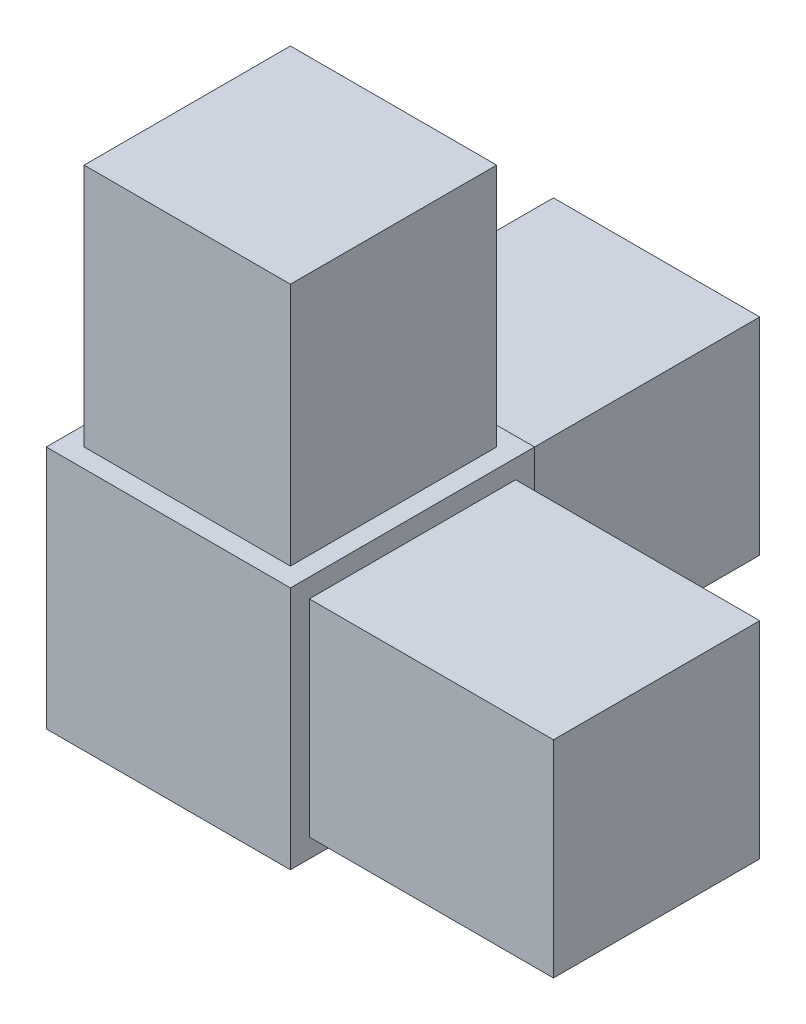
ISO-10303-21;
HEADER;
FILE_DESCRIPTION(('STEP AP214'),'2;1');
FILE_NAME('part.step','',(''),(''),'','','');
FILE_SCHEMA(('AUTOMOTIVE_DESIGN { 1 0 10303 214 1 1 1 1 }'));
ENDSEC;
DATA;
#1=APPLICATION_CONTEXT('core data for automotive mechanical design processes');
#2=APPLICATION_PROTOCOL_DEFINITION('international standard','automotive_design',2000,#1);
#3=PRODUCT_CONTEXT('',#1,'mechanical');
#4=PRODUCT('Part','Part','',(#3));
#5=PRODUCT_RELATED_PRODUCT_CATEGORY('part','',(#4));
#6=PRODUCT_DEFINITION_FORMATION('','',#4);
#7=PRODUCT_DEFINITION_CONTEXT('part definition',#1,'design');
#8=PRODUCT_DEFINITION('design','',#6,#7);
#9=PRODUCT_DEFINITION_SHAPE('','',#8);
#10=(LENGTH_UNIT() NAMED_UNIT(*) SI_UNIT(.MILLI.,.METRE.));
#11=(NAMED_UNIT(*) PLANE_ANGLE_UNIT() SI_UNIT($,.RADIAN.));
#12=(NAMED_UNIT(*) SI_UNIT($,.STERADIAN.) SOLID_ANGLE_UNIT());
#13=UNCERTAINTY_MEASURE_WITH_UNIT(LENGTH_MEASURE(1.E-05),#10,'distance_accuracy_value','');
#14=(GEOMETRIC_REPRESENTATION_CONTEXT(3) GLOBAL_UNCERTAINTY_ASSIGNED_CONTEXT((#13)) GLOBAL_UNIT_ASSIGNED_CONTEXT((#10,
#11,#12)) REPRESENTATION_CONTEXT('',''));
#15=CARTESIAN_POINT('',(0.,0.,0.));
#16=DIRECTION('',(0.,0.,1.));
#17=DIRECTION('',(1.,0.,0.));
#18=AXIS2_PLACEMENT_3D('',#15,#16,#17);
#19=CARTESIAN_POINT('',(10.,20.,10.));
#20=DIRECTION('',(-1.,0.,0.));
#21=DIRECTION('',(0.,0.,1.));
#22=AXIS2_PLACEMENT_3D('',#19,#20,#21);
#23=PLANE('',#22);
#24=DIRECTION('',(0.,0.,-1.));
#25=VECTOR('',#24,1.);
#26=CARTESIAN_POINT('',(10.,0.,10.));
#27=LINE('',#26,#25);
#28=CARTESIAN_POINT('',(10.,0.,10.));
#29=VERTEX_POINT('',#28);
#30=CARTESIAN_POINT('',(10.,0.,-10.));
#31=VERTEX_POINT('',#30);
#32=EDGE_CURVE('E259',#29,#31,#27,.T.);
#33=ORIENTED_EDGE('',*,*,#32,.T.);
#34=DIRECTION('',(0.,-1.,0.));
#35=VECTOR('',#34,1.);
#36=CARTESIAN_POINT('',(10.,20.,-10.));
#37=LINE('',#36,#35);
#38=CARTESIAN_POINT('',(10.,20.,-10.));
#39=VERTEX_POINT('',#38);
#40=EDGE_CURVE('E264',#39,#31,#37,.T.);
#41=ORIENTED_EDGE('',*,*,#40,.F.);
#42=DIRECTION('',(0.,0.,-1.));
#43=VECTOR('',#42,1.);
#44=CARTESIAN_POINT('',(10.,20.,10.));
#45=LINE('',#44,#43);
#46=CARTESIAN_POINT('',(10.,20.,10.));
#47=VERTEX_POINT('',#46);
#48=EDGE_CURVE('E250',#47,#39,#45,.T.);
#49=ORIENTED_EDGE('',*,*,#48,.F.);
#50=DIRECTION('',(0.,-1.,0.));
#51=VECTOR('',#50,1.);
#52=CARTESIAN_POINT('',(10.,20.,10.));
#53=LINE('',#52,#51);
#54=EDGE_CURVE('E46',#47,#29,#53,.T.);
#55=ORIENTED_EDGE('',*,*,#54,.T.);
#56=EDGE_LOOP('',(#33,#41,#49,#55));
#57=FACE_BOUND('',#56,.T.);
#58=DIRECTION('',(0.,-1.,0.));
#59=VECTOR('',#58,1.);
#60=CARTESIAN_POINT('',(10.,18.45,8.45));
#61=LINE('',#60,#59);
#62=CARTESIAN_POINT('',(10.,18.45,8.45));
#63=VERTEX_POINT('',#62);
#64=CARTESIAN_POINT('',(10.,1.55,8.45));
#65=VERTEX_POINT('',#64);
#66=EDGE_CURVE('E171',#63,#65,#61,.T.);
#67=ORIENTED_EDGE('',*,*,#66,.F.);
#68=DIRECTION('',(0.,0.,1.));
#69=VECTOR('',#68,1.);
#70=CARTESIAN_POINT('',(10.,18.45,-8.45));
#71=LINE('',#70,#69);
#72=CARTESIAN_POINT('',(10.,18.45,-8.45));
#73=VERTEX_POINT('',#72);
#74=EDGE_CURVE('E184',#73,#63,#71,.T.);
#75=ORIENTED_EDGE('',*,*,#74,.F.);
#76=DIRECTION('',(0.,1.,0.));
#77=VECTOR('',#76,1.);
#78=CARTESIAN_POINT('',(10.,1.55,-8.45));
#79=LINE('',#78,#77);
#80=CARTESIAN_POINT('',(10.,1.55,-8.45));
#81=VERTEX_POINT('',#80);
#82=EDGE_CURVE('E193',#81,#73,#79,.T.);
#83=ORIENTED_EDGE('',*,*,#82,.F.);
#84=DIRECTION('',(0.,0.,-1.));
#85=VECTOR('',#84,1.);
#86=CARTESIAN_POINT('',(10.,1.55,8.45));
#87=LINE('',#86,#85);
#88=EDGE_CURVE('E174',#65,#81,#87,.T.);
#89=ORIENTED_EDGE('',*,*,#88,.F.);
#90=EDGE_LOOP('',(#67,#75,#83,#89));
#91=FACE_BOUND('',#90,.T.);
#92=ADVANCED_FACE('F37',(#57,#91),#23,.F.);
#93=CARTESIAN_POINT('',(0.,20.,0.));
#94=DIRECTION('',(0.,-1.,0.));
#95=DIRECTION('',(0.,0.,-1.));
#96=AXIS2_PLACEMENT_3D('',#93,#94,#95);
#97=PLANE('',#96);
#98=DIRECTION('',(0.,0.,-1.));
#99=VECTOR('',#98,1.);
#100=CARTESIAN_POINT('',(-10.,20.,10.));
#101=LINE('',#100,#99);
#102=CARTESIAN_POINT('',(-10.,20.,10.));
#103=VERTEX_POINT('',#102);
#104=CARTESIAN_POINT('',(-10.,20.,-10.));
#105=VERTEX_POINT('',#104);
#106=EDGE_CURVE('E243',#103,#105,#101,.T.);
#107=ORIENTED_EDGE('',*,*,#106,.F.);
#108=DIRECTION('',(1.,0.,0.));
#109=VECTOR('',#108,1.);
#110=CARTESIAN_POINT('',(-10.,20.,10.));
#111=LINE('',#110,#109);
#112=EDGE_CURVE('E252',#103,#47,#111,.T.);
#113=ORIENTED_EDGE('',*,*,#112,.T.);
#114=ORIENTED_EDGE('',*,*,#48,.T.);
#115=DIRECTION('',(1.,0.,0.));
#116=VECTOR('',#115,1.);
#117=CARTESIAN_POINT('',(-10.,20.,-10.));
#118=LINE('',#117,#116);
#119=EDGE_CURVE('E246',#105,#39,#118,.T.);
#120=ORIENTED_EDGE('',*,*,#119,.F.);
#121=EDGE_LOOP('',(#107,#113,#114,#120));
#122=FACE_BOUND('',#121,.T.);
#123=DIRECTION('',(0.,0.,1.));
#124=VECTOR('',#123,1.);
#125=CARTESIAN_POINT('',(-8.45,20.,-8.45));
#126=LINE('',#125,#124);
#127=CARTESIAN_POINT('',(-8.45,20.,-8.45));
#128=VERTEX_POINT('',#127);
#129=CARTESIAN_POINT('',(-8.45,20.,8.45));
#130=VERTEX_POINT('',#129);
#131=EDGE_CURVE('E209',#128,#130,#126,.T.);
#132=ORIENTED_EDGE('',*,*,#131,.F.);
#133=DIRECTION('',(-1.,0.,0.));
#134=VECTOR('',#133,1.);
#135=CARTESIAN_POINT('',(8.45,20.,-8.45));
#136=LINE('',#135,#134);
#137=CARTESIAN_POINT('',(8.45,20.,-8.45));
#138=VERTEX_POINT('',#137);
#139=EDGE_CURVE('E214',#138,#128,#136,.T.);
#140=ORIENTED_EDGE('',*,*,#139,.F.);
#141=DIRECTION('',(0.,0.,-1.));
#142=VECTOR('',#141,1.);
#143=CARTESIAN_POINT('',(8.45,20.,8.45));
#144=LINE('',#143,#142);
#145=CARTESIAN_POINT('',(8.45,20.,8.45));
#146=VERTEX_POINT('',#145);
#147=EDGE_CURVE('E226',#146,#138,#144,.T.);
#148=ORIENTED_EDGE('',*,*,#147,.F.);
#149=DIRECTION('',(1.,0.,0.));
#150=VECTOR('',#149,1.);
#151=CARTESIAN_POINT('',(-8.45,20.,8.45));
#152=LINE('',#151,#150);
#153=EDGE_CURVE('E223',#130,#146,#152,.T.);
#154=ORIENTED_EDGE('',*,*,#153,.F.);
#155=EDGE_LOOP('',(#132,#140,#148,#154));
#156=FACE_BOUND('',#155,.T.);
#157=ADVANCED_FACE('F285',(#122,#156),#97,.F.);
#158=CARTESIAN_POINT('',(-10.,20.,10.));
#159=DIRECTION('',(-1.,0.,0.));
#160=DIRECTION('',(0.,0.,1.));
#161=AXIS2_PLACEMENT_3D('',#158,#159,#160);
#162=PLANE('',#161);
#163=DIRECTION('',(0.,0.,-1.));
#164=VECTOR('',#163,1.);
#165=CARTESIAN_POINT('',(-10.,0.,10.));
#166=LINE('',#165,#164);
#167=CARTESIAN_POINT('',(-10.,0.,10.));
#168=VERTEX_POINT('',#167);
#169=CARTESIAN_POINT('',(-10.,0.,-10.));
#170=VERTEX_POINT('',#169);
#171=EDGE_CURVE('E242',#168,#170,#166,.T.);
#172=ORIENTED_EDGE('',*,*,#171,.F.);
#173=DIRECTION('',(0.,-1.,0.));
#174=VECTOR('',#173,1.);
#175=CARTESIAN_POINT('',(-10.,20.,10.));
#176=LINE('',#175,#174);
#177=EDGE_CURVE('E11',#103,#168,#176,.T.);
#178=ORIENTED_EDGE('',*,*,#177,.F.);
#179=ORIENTED_EDGE('',*,*,#106,.T.);
#180=DIRECTION('',(0.,-1.,0.));
#181=VECTOR('',#180,1.);
#182=CARTESIAN_POINT('',(-10.,20.,-10.));
#183=LINE('',#182,#181);
#184=EDGE_CURVE('E41',#105,#170,#183,.T.);
#185=ORIENTED_EDGE('',*,*,#184,.T.);
#186=EDGE_LOOP('',(#172,#178,#179,#185));
#187=FACE_BOUND('',#186,.T.);
#188=ADVANCED_FACE('F39',(#187),#162,.T.);
#189=CARTESIAN_POINT('',(-10.,20.,10.));
#190=DIRECTION('',(0.,0.,-1.));
#191=DIRECTION('',(-1.,0.,0.));
#192=AXIS2_PLACEMENT_3D('',#189,#190,#191);
#193=PLANE('',#192);
#194=DIRECTION('',(1.,0.,0.));
#195=VECTOR('',#194,1.);
#196=CARTESIAN_POINT('',(-10.,0.,10.));
#197=LINE('',#196,#195);
#198=EDGE_CURVE('E247',#168,#29,#197,.T.);
#199=ORIENTED_EDGE('',*,*,#198,.T.);
#200=ORIENTED_EDGE('',*,*,#54,.F.);
#201=ORIENTED_EDGE('',*,*,#112,.F.);
#202=ORIENTED_EDGE('',*,*,#177,.T.);
#203=EDGE_LOOP('',(#199,#200,#201,#202));
#204=FACE_BOUND('',#203,.T.);
#205=ADVANCED_FACE('F279',(#204),#193,.F.);
#206=CARTESIAN_POINT('',(-10.,20.,-10.));
#207=DIRECTION('',(0.,0.,-1.));
#208=DIRECTION('',(-1.,0.,0.));
#209=AXIS2_PLACEMENT_3D('',#206,#207,#208);
#210=PLANE('',#209);
#211=DIRECTION('',(0.,-1.,0.));
#212=VECTOR('',#211,1.);
#213=CARTESIAN_POINT('',(8.45,18.45,-10.));
#214=LINE('',#213,#212);
#215=CARTESIAN_POINT('',(8.45,18.45,-10.));
#216=VERTEX_POINT('',#215);
#217=CARTESIAN_POINT('',(8.45,1.55,-10.));
#218=VERTEX_POINT('',#217);
#219=EDGE_CURVE('E54',#216,#218,#214,.T.);
#220=ORIENTED_EDGE('',*,*,#219,.F.);
#221=DIRECTION('',(1.,0.,0.));
#222=VECTOR('',#221,1.);
#223=CARTESIAN_POINT('',(-8.45,18.45,-10.));
#224=LINE('',#223,#222);
#225=CARTESIAN_POINT('',(-8.45,18.45,-10.));
#226=VERTEX_POINT('',#225);
#227=EDGE_CURVE('E58',#226,#216,#224,.T.);
#228=ORIENTED_EDGE('',*,*,#227,.F.);
#229=DIRECTION('',(0.,1.,0.));
#230=VECTOR('',#229,1.);
#231=CARTESIAN_POINT('',(-8.45,1.55,-10.));
#232=LINE('',#231,#230);
#233=CARTESIAN_POINT('',(-8.45,1.55,-10.));
#234=VERTEX_POINT('',#233);
#235=EDGE_CURVE('E506',#234,#226,#232,.T.);
#236=ORIENTED_EDGE('',*,*,#235,.F.);
#237=DIRECTION('',(-1.,0.,0.));
#238=VECTOR('',#237,1.);
#239=CARTESIAN_POINT('',(8.45,1.55,-10.));
#240=LINE('',#239,#238);
#241=EDGE_CURVE('E512',#218,#234,#240,.T.);
#242=ORIENTED_EDGE('',*,*,#241,.F.);
#243=EDGE_LOOP('',(#220,#228,#236,#242));
#244=FACE_BOUND('',#243,.T.);
#245=DIRECTION('',(1.,0.,0.));
#246=VECTOR('',#245,1.);
#247=CARTESIAN_POINT('',(-10.,0.,-10.));
#248=LINE('',#247,#246);
#249=EDGE_CURVE('E256',#170,#31,#248,.T.);
#250=ORIENTED_EDGE('',*,*,#249,.F.);
#251=ORIENTED_EDGE('',*,*,#184,.F.);
#252=ORIENTED_EDGE('',*,*,#119,.T.);
#253=ORIENTED_EDGE('',*,*,#40,.T.);
#254=EDGE_LOOP('',(#250,#251,#252,#253));
#255=FACE_BOUND('',#254,.T.);
#256=ADVANCED_FACE('F272',(#244,#255),#210,.T.);
#257=CARTESIAN_POINT('',(0.,0.,0.));
#258=DIRECTION('',(0.,-1.,0.));
#259=DIRECTION('',(0.,0.,-1.));
#260=AXIS2_PLACEMENT_3D('',#257,#258,#259);
#261=PLANE('',#260);
#262=ORIENTED_EDGE('',*,*,#171,.T.);
#263=ORIENTED_EDGE('',*,*,#249,.T.);
#264=ORIENTED_EDGE('',*,*,#32,.F.);
#265=ORIENTED_EDGE('',*,*,#198,.F.);
#266=EDGE_LOOP('',(#262,#263,#264,#265));
#267=FACE_BOUND('',#266,.T.);
#268=ADVANCED_FACE('F276',(#267),#261,.T.);
#269=CARTESIAN_POINT('',(-8.45,40.,-8.45));
#270=DIRECTION('',(1.,0.,0.));
#271=DIRECTION('',(0.,0.,-1.));
#272=AXIS2_PLACEMENT_3D('',#269,#270,#271);
#273=PLANE('',#272);
#274=ORIENTED_EDGE('',*,*,#131,.T.);
#275=DIRECTION('',(0.,-1.,0.));
#276=VECTOR('',#275,1.);
#277=CARTESIAN_POINT('',(-8.45,40.,8.45));
#278=LINE('',#277,#276);
#279=CARTESIAN_POINT('',(-8.45,40.,8.45));
#280=VERTEX_POINT('',#279);
#281=EDGE_CURVE('E239',#280,#130,#278,.T.);
#282=ORIENTED_EDGE('',*,*,#281,.F.);
#283=DIRECTION('',(0.,0.,1.));
#284=VECTOR('',#283,1.);
#285=CARTESIAN_POINT('',(-8.45,40.,-8.45));
#286=LINE('',#285,#284);
#287=CARTESIAN_POINT('',(-8.45,40.,-8.45));
#288=VERTEX_POINT('',#287);
#289=EDGE_CURVE('E210',#288,#280,#286,.T.);
#290=ORIENTED_EDGE('',*,*,#289,.F.);
#291=DIRECTION('',(0.,-1.,0.));
#292=VECTOR('',#291,1.);
#293=CARTESIAN_POINT('',(-8.45,40.,-8.45));
#294=LINE('',#293,#292);
#295=EDGE_CURVE('E220',#288,#128,#294,.T.);
#296=ORIENTED_EDGE('',*,*,#295,.T.);
#297=EDGE_LOOP('',(#274,#282,#290,#296));
#298=FACE_BOUND('',#297,.T.);
#299=ADVANCED_FACE('F297',(#298),#273,.F.);
#300=CARTESIAN_POINT('',(-8.45,40.,8.45));
#301=DIRECTION('',(0.,0.,-1.));
#302=DIRECTION('',(-1.,0.,0.));
#303=AXIS2_PLACEMENT_3D('',#300,#301,#302);
#304=PLANE('',#303);
#305=ORIENTED_EDGE('',*,*,#153,.T.);
#306=DIRECTION('',(0.,-1.,0.));
#307=VECTOR('',#306,1.);
#308=CARTESIAN_POINT('',(8.45,40.,8.45));
#309=LINE('',#308,#307);
#310=CARTESIAN_POINT('',(8.45,40.,8.45));
#311=VERTEX_POINT('',#310);
#312=EDGE_CURVE('E236',#311,#146,#309,.T.);
#313=ORIENTED_EDGE('',*,*,#312,.F.);
#314=DIRECTION('',(1.,0.,0.));
#315=VECTOR('',#314,1.);
#316=CARTESIAN_POINT('',(-8.45,40.,8.45));
#317=LINE('',#316,#315);
#318=EDGE_CURVE('E213',#280,#311,#317,.T.);
#319=ORIENTED_EDGE('',*,*,#318,.F.);
#320=ORIENTED_EDGE('',*,*,#281,.T.);
#321=EDGE_LOOP('',(#305,#313,#319,#320));
#322=FACE_BOUND('',#321,.T.);
#323=ADVANCED_FACE('F305',(#322),#304,.F.);
#324=CARTESIAN_POINT('',(8.45,40.,8.45));
#325=DIRECTION('',(-1.,0.,0.));
#326=DIRECTION('',(0.,0.,1.));
#327=AXIS2_PLACEMENT_3D('',#324,#325,#326);
#328=PLANE('',#327);
#329=ORIENTED_EDGE('',*,*,#147,.T.);
#330=DIRECTION('',(0.,-1.,0.));
#331=VECTOR('',#330,1.);
#332=CARTESIAN_POINT('',(8.45,40.,-8.45));
#333=LINE('',#332,#331);
#334=CARTESIAN_POINT('',(8.45,40.,-8.45));
#335=VERTEX_POINT('',#334);
#336=EDGE_CURVE('E233',#335,#138,#333,.T.);
#337=ORIENTED_EDGE('',*,*,#336,.F.);
#338=DIRECTION('',(0.,0.,-1.));
#339=VECTOR('',#338,1.);
#340=CARTESIAN_POINT('',(8.45,40.,8.45));
#341=LINE('',#340,#339);
#342=EDGE_CURVE('E216',#311,#335,#341,.T.);
#343=ORIENTED_EDGE('',*,*,#342,.F.);
#344=ORIENTED_EDGE('',*,*,#312,.T.);
#345=EDGE_LOOP('',(#329,#337,#343,#344));
#346=FACE_BOUND('',#345,.T.);
#347=ADVANCED_FACE('F303',(#346),#328,.F.);
#348=CARTESIAN_POINT('',(8.45,40.,-8.45));
#349=DIRECTION('',(0.,0.,1.));
#350=DIRECTION('',(1.,0.,0.));
#351=AXIS2_PLACEMENT_3D('',#348,#349,#350);
#352=PLANE('',#351);
#353=ORIENTED_EDGE('',*,*,#139,.T.);
#354=ORIENTED_EDGE('',*,*,#295,.F.);
#355=DIRECTION('',(-1.,0.,0.));
#356=VECTOR('',#355,1.);
#357=CARTESIAN_POINT('',(8.45,40.,-8.45));
#358=LINE('',#357,#356);
#359=EDGE_CURVE('E218',#335,#288,#358,.T.);
#360=ORIENTED_EDGE('',*,*,#359,.F.);
#361=ORIENTED_EDGE('',*,*,#336,.T.);
#362=EDGE_LOOP('',(#353,#354,#360,#361));
#363=FACE_BOUND('',#362,.T.);
#364=ADVANCED_FACE('F293',(#363),#352,.F.);
#365=CARTESIAN_POINT('',(0.,40.,0.));
#366=DIRECTION('',(0.,1.,0.));
#367=DIRECTION('',(0.,0.,1.));
#368=AXIS2_PLACEMENT_3D('',#365,#366,#367);
#369=PLANE('',#368);
#370=ORIENTED_EDGE('',*,*,#289,.T.);
#371=ORIENTED_EDGE('',*,*,#318,.T.);
#372=ORIENTED_EDGE('',*,*,#342,.T.);
#373=ORIENTED_EDGE('',*,*,#359,.T.);
#374=EDGE_LOOP('',(#370,#371,#372,#373));
#375=FACE_BOUND('',#374,.T.);
#376=ADVANCED_FACE('F299',(#375),#369,.T.);
#377=CARTESIAN_POINT('',(30.,18.45,8.45));
#378=DIRECTION('',(0.,0.,-1.));
#379=DIRECTION('',(-1.,0.,0.));
#380=AXIS2_PLACEMENT_3D('',#377,#378,#379);
#381=PLANE('',#380);
#382=ORIENTED_EDGE('',*,*,#66,.T.);
#383=DIRECTION('',(-1.,0.,0.));
#384=VECTOR('',#383,1.);
#385=CARTESIAN_POINT('',(30.,1.55,8.45));
#386=LINE('',#385,#384);
#387=CARTESIAN_POINT('',(30.,1.55,8.45));
#388=VERTEX_POINT('',#387);
#389=EDGE_CURVE('E206',#388,#65,#386,.T.);
#390=ORIENTED_EDGE('',*,*,#389,.F.);
#391=DIRECTION('',(0.,-1.,0.));
#392=VECTOR('',#391,1.);
#393=CARTESIAN_POINT('',(30.,18.45,8.45));
#394=LINE('',#393,#392);
#395=CARTESIAN_POINT('',(30.,18.45,8.45));
#396=VERTEX_POINT('',#395);
#397=EDGE_CURVE('E180',#396,#388,#394,.T.);
#398=ORIENTED_EDGE('',*,*,#397,.F.);
#399=DIRECTION('',(-1.,0.,0.));
#400=VECTOR('',#399,1.);
#401=CARTESIAN_POINT('',(30.,18.45,8.45));
#402=LINE('',#401,#400);
#403=EDGE_CURVE('E189',#396,#63,#402,.T.);
#404=ORIENTED_EDGE('',*,*,#403,.T.);
#405=EDGE_LOOP('',(#382,#390,#398,#404));
#406=FACE_BOUND('',#405,.T.);
#407=ADVANCED_FACE('F374',(#406),#381,.F.);
#408=CARTESIAN_POINT('',(30.,1.55,8.45));
#409=DIRECTION('',(0.,1.,0.));
#410=DIRECTION('',(0.,0.,1.));
#411=AXIS2_PLACEMENT_3D('',#408,#409,#410);
#412=PLANE('',#411);
#413=ORIENTED_EDGE('',*,*,#88,.T.);
#414=DIRECTION('',(-1.,0.,0.));
#415=VECTOR('',#414,1.);
#416=CARTESIAN_POINT('',(30.,1.55,-8.45));
#417=LINE('',#416,#415);
#418=CARTESIAN_POINT('',(30.,1.55,-8.45));
#419=VERTEX_POINT('',#418);
#420=EDGE_CURVE('E203',#419,#81,#417,.T.);
#421=ORIENTED_EDGE('',*,*,#420,.F.);
#422=DIRECTION('',(0.,0.,-1.));
#423=VECTOR('',#422,1.);
#424=CARTESIAN_POINT('',(30.,1.55,8.45));
#425=LINE('',#424,#423);
#426=EDGE_CURVE('E183',#388,#419,#425,.T.);
#427=ORIENTED_EDGE('',*,*,#426,.F.);
#428=ORIENTED_EDGE('',*,*,#389,.T.);
#429=EDGE_LOOP('',(#413,#421,#427,#428));
#430=FACE_BOUND('',#429,.T.);
#431=ADVANCED_FACE('F390',(#430),#412,.F.);
#432=CARTESIAN_POINT('',(30.,1.55,-8.45));
#433=DIRECTION('',(0.,0.,1.));
#434=DIRECTION('',(1.,0.,0.));
#435=AXIS2_PLACEMENT_3D('',#432,#433,#434);
#436=PLANE('',#435);
#437=ORIENTED_EDGE('',*,*,#82,.T.);
#438=DIRECTION('',(-1.,0.,0.));
#439=VECTOR('',#438,1.);
#440=CARTESIAN_POINT('',(30.,18.45,-8.45));
#441=LINE('',#440,#439);
#442=CARTESIAN_POINT('',(30.,18.45,-8.45));
#443=VERTEX_POINT('',#442);
#444=EDGE_CURVE('E200',#443,#73,#441,.T.);
#445=ORIENTED_EDGE('',*,*,#444,.F.);
#446=DIRECTION('',(0.,1.,0.));
#447=VECTOR('',#446,1.);
#448=CARTESIAN_POINT('',(30.,1.55,-8.45));
#449=LINE('',#448,#447);
#450=EDGE_CURVE('E186',#419,#443,#449,.T.);
#451=ORIENTED_EDGE('',*,*,#450,.F.);
#452=ORIENTED_EDGE('',*,*,#420,.T.);
#453=EDGE_LOOP('',(#437,#445,#451,#452));
#454=FACE_BOUND('',#453,.T.);
#455=ADVANCED_FACE('F400',(#454),#436,.F.);
#456=CARTESIAN_POINT('',(30.,18.45,-8.45));
#457=DIRECTION('',(0.,-1.,0.));
#458=DIRECTION('',(0.,0.,-1.));
#459=AXIS2_PLACEMENT_3D('',#456,#457,#458);
#460=PLANE('',#459);
#461=ORIENTED_EDGE('',*,*,#74,.T.);
#462=ORIENTED_EDGE('',*,*,#403,.F.);
#463=DIRECTION('',(0.,0.,1.));
#464=VECTOR('',#463,1.);
#465=CARTESIAN_POINT('',(30.,18.45,-8.45));
#466=LINE('',#465,#464);
#467=EDGE_CURVE('E188',#443,#396,#466,.T.);
#468=ORIENTED_EDGE('',*,*,#467,.F.);
#469=ORIENTED_EDGE('',*,*,#444,.T.);
#470=EDGE_LOOP('',(#461,#462,#468,#469));
#471=FACE_BOUND('',#470,.T.);
#472=ADVANCED_FACE('F411',(#471),#460,.F.);
#473=CARTESIAN_POINT('',(30.,0.,0.));
#474=DIRECTION('',(1.,0.,0.));
#475=DIRECTION('',(0.,0.,-1.));
#476=AXIS2_PLACEMENT_3D('',#473,#474,#475);
#477=PLANE('',#476);
#478=ORIENTED_EDGE('',*,*,#397,.T.);
#479=ORIENTED_EDGE('',*,*,#426,.T.);
#480=ORIENTED_EDGE('',*,*,#450,.T.);
#481=ORIENTED_EDGE('',*,*,#467,.T.);
#482=EDGE_LOOP('',(#478,#479,#480,#481));
#483=FACE_BOUND('',#482,.T.);
#484=ADVANCED_FACE('F422',(#483),#477,.T.);
#485=CARTESIAN_POINT('',(8.45,18.45,-30.));
#486=DIRECTION('',(-1.,0.,0.));
#487=DIRECTION('',(0.,0.,1.));
#488=AXIS2_PLACEMENT_3D('',#485,#486,#487);
#489=PLANE('',#488);
#490=ORIENTED_EDGE('',*,*,#219,.T.);
#491=DIRECTION('',(0.,0.,1.));
#492=VECTOR('',#491,1.);
#493=CARTESIAN_POINT('',(8.45,1.55,-30.));
#494=LINE('',#493,#492);
#495=CARTESIAN_POINT('',(8.45,1.55,-30.));
#496=VERTEX_POINT('',#495);
#497=EDGE_CURVE('E154',#496,#218,#494,.T.);
#498=ORIENTED_EDGE('',*,*,#497,.F.);
#499=DIRECTION('',(0.,-1.,0.));
#500=VECTOR('',#499,1.);
#501=CARTESIAN_POINT('',(8.45,18.45,-30.));
#502=LINE('',#501,#500);
#503=CARTESIAN_POINT('',(8.45,18.45,-30.));
#504=VERTEX_POINT('',#503);
#505=EDGE_CURVE('E160',#504,#496,#502,.T.);
#506=ORIENTED_EDGE('',*,*,#505,.F.);
#507=DIRECTION('',(0.,0.,1.));
#508=VECTOR('',#507,1.);
#509=CARTESIAN_POINT('',(8.45,18.45,-30.));
#510=LINE('',#509,#508);
#511=EDGE_CURVE('E504',#504,#216,#510,.T.);
#512=ORIENTED_EDGE('',*,*,#511,.T.);
#513=EDGE_LOOP('',(#490,#498,#506,#512));
#514=FACE_BOUND('',#513,.T.);
#515=ADVANCED_FACE('F170',(#514),#489,.F.);
#516=CARTESIAN_POINT('',(8.45,1.55,-30.));
#517=DIRECTION('',(0.,1.,0.));
#518=DIRECTION('',(0.,0.,1.));
#519=AXIS2_PLACEMENT_3D('',#516,#517,#518);
#520=PLANE('',#519);
#521=ORIENTED_EDGE('',*,*,#241,.T.);
#522=DIRECTION('',(0.,0.,1.));
#523=VECTOR('',#522,1.);
#524=CARTESIAN_POINT('',(-8.45,1.55,-30.));
#525=LINE('',#524,#523);
#526=CARTESIAN_POINT('',(-8.45,1.55,-30.));
#527=VERTEX_POINT('',#526);
#528=EDGE_CURVE('E156',#527,#234,#525,.T.);
#529=ORIENTED_EDGE('',*,*,#528,.F.);
#530=DIRECTION('',(-1.,0.,0.));
#531=VECTOR('',#530,1.);
#532=CARTESIAN_POINT('',(8.45,1.55,-30.));
#533=LINE('',#532,#531);
#534=EDGE_CURVE('E149',#496,#527,#533,.T.);
#535=ORIENTED_EDGE('',*,*,#534,.F.);
#536=ORIENTED_EDGE('',*,*,#497,.T.);
#537=EDGE_LOOP('',(#521,#529,#535,#536));
#538=FACE_BOUND('',#537,.T.);
#539=ADVANCED_FACE('F152',(#538),#520,.F.);
#540=CARTESIAN_POINT('',(-8.45,1.55,-30.));
#541=DIRECTION('',(1.,0.,0.));
#542=DIRECTION('',(0.,0.,-1.));
#543=AXIS2_PLACEMENT_3D('',#540,#541,#542);
#544=PLANE('',#543);
#545=ORIENTED_EDGE('',*,*,#235,.T.);
#546=DIRECTION('',(0.,0.,1.));
#547=VECTOR('',#546,1.);
#548=CARTESIAN_POINT('',(-8.45,18.45,-30.));
#549=LINE('',#548,#547);
#550=CARTESIAN_POINT('',(-8.45,18.45,-30.));
#551=VERTEX_POINT('',#550);
#552=EDGE_CURVE('E176',#551,#226,#549,.T.);
#553=ORIENTED_EDGE('',*,*,#552,.F.);
#554=DIRECTION('',(0.,1.,0.));
#555=VECTOR('',#554,1.);
#556=CARTESIAN_POINT('',(-8.45,1.55,-30.));
#557=LINE('',#556,#555);
#558=EDGE_CURVE('E159',#527,#551,#557,.T.);
#559=ORIENTED_EDGE('',*,*,#558,.F.);
#560=ORIENTED_EDGE('',*,*,#528,.T.);
#561=EDGE_LOOP('',(#545,#553,#559,#560));
#562=FACE_BOUND('',#561,.T.);
#563=ADVANCED_FACE('F458',(#562),#544,.F.);
#564=CARTESIAN_POINT('',(-8.45,18.45,-30.));
#565=DIRECTION('',(0.,-1.,0.));
#566=DIRECTION('',(0.,0.,-1.));
#567=AXIS2_PLACEMENT_3D('',#564,#565,#566);
#568=PLANE('',#567);
#569=ORIENTED_EDGE('',*,*,#227,.T.);
#570=ORIENTED_EDGE('',*,*,#511,.F.);
#571=DIRECTION('',(1.,0.,0.));
#572=VECTOR('',#571,1.);
#573=CARTESIAN_POINT('',(-8.45,18.45,-30.));
#574=LINE('',#573,#572);
#575=EDGE_CURVE('E165',#551,#504,#574,.T.);
#576=ORIENTED_EDGE('',*,*,#575,.F.);
#577=ORIENTED_EDGE('',*,*,#552,.T.);
#578=EDGE_LOOP('',(#569,#570,#576,#577));
#579=FACE_BOUND('',#578,.T.);
#580=ADVANCED_FACE('F468',(#579),#568,.F.);
#581=CARTESIAN_POINT('',(0.,0.,-30.));
#582=DIRECTION('',(0.,0.,-1.));
#583=DIRECTION('',(-1.,0.,0.));
#584=AXIS2_PLACEMENT_3D('',#581,#582,#583);
#585=PLANE('',#584);
#586=ORIENTED_EDGE('',*,*,#505,.T.);
#587=ORIENTED_EDGE('',*,*,#534,.T.);
#588=ORIENTED_EDGE('',*,*,#558,.T.);
#589=ORIENTED_EDGE('',*,*,#575,.T.);
#590=EDGE_LOOP('',(#586,#587,#588,#589));
#591=FACE_BOUND('',#590,.T.);
#592=ADVANCED_FACE('F163',(#591),#585,.T.);
#593=CLOSED_SHELL('',(#92,#157,#188,#205,#256,#268,#299,#323,#347,#364,#376,#407,#431,#455,#472,
#484,#515,#539,#563,#580,#592));
#594=MANIFOLD_SOLID_BREP('B2',#593);
#595=ADVANCED_BREP_SHAPE_REPRESENTATION('',(#18,#594),#14);
#596=SHAPE_DEFINITION_REPRESENTATION(#9,#595);
ENDSEC;
END-ISO-10303-21;
